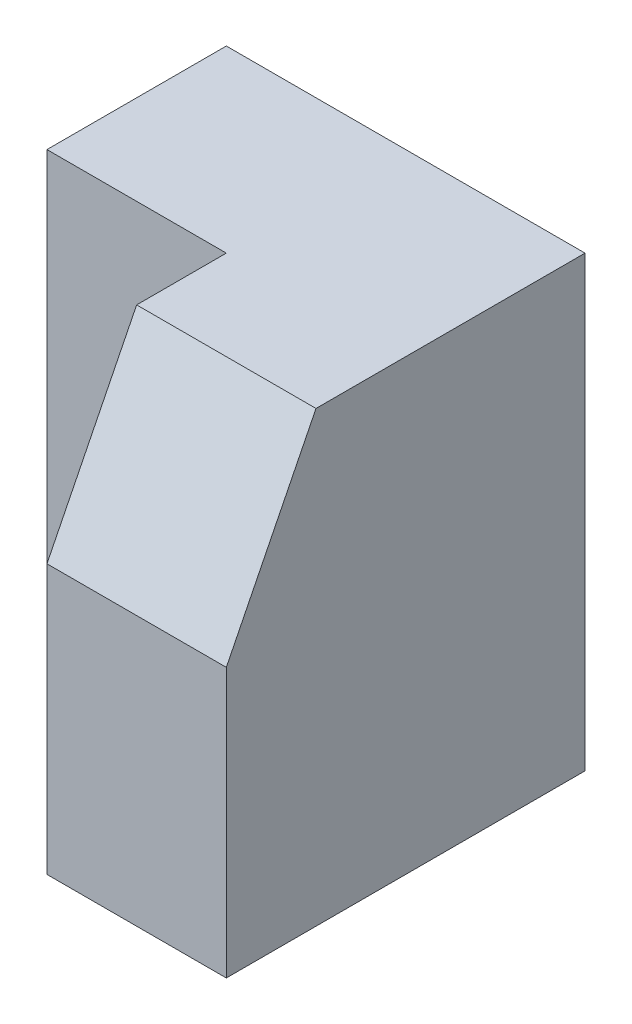
ISO-10303-21;
HEADER;
FILE_DESCRIPTION(('STEP AP214'),'2;1');
FILE_NAME('part.step','',(''),(''),'','','');
FILE_SCHEMA(('AUTOMOTIVE_DESIGN { 1 0 10303 214 1 1 1 1 }'));
ENDSEC;
DATA;
#1=APPLICATION_CONTEXT('core data for automotive mechanical design processes');
#2=APPLICATION_PROTOCOL_DEFINITION('international standard','automotive_design',2000,#1);
#3=PRODUCT_CONTEXT('',#1,'mechanical');
#4=PRODUCT('Part','Part','',(#3));
#5=PRODUCT_RELATED_PRODUCT_CATEGORY('part','',(#4));
#6=PRODUCT_DEFINITION_FORMATION('','',#4);
#7=PRODUCT_DEFINITION_CONTEXT('part definition',#1,'design');
#8=PRODUCT_DEFINITION('design','',#6,#7);
#9=PRODUCT_DEFINITION_SHAPE('','',#8);
#10=(LENGTH_UNIT() NAMED_UNIT(*) SI_UNIT(.MILLI.,.METRE.));
#11=(NAMED_UNIT(*) PLANE_ANGLE_UNIT() SI_UNIT($,.RADIAN.));
#12=(NAMED_UNIT(*) SI_UNIT($,.STERADIAN.) SOLID_ANGLE_UNIT());
#13=UNCERTAINTY_MEASURE_WITH_UNIT(LENGTH_MEASURE(1.E-05),#10,'distance_accuracy_value','');
#14=(GEOMETRIC_REPRESENTATION_CONTEXT(3) GLOBAL_UNCERTAINTY_ASSIGNED_CONTEXT((#13)) GLOBAL_UNIT_ASSIGNED_CONTEXT((#10,
#11,#12)) REPRESENTATION_CONTEXT('',''));
#15=CARTESIAN_POINT('',(0.,0.,0.));
#16=DIRECTION('',(0.,0.,1.));
#17=DIRECTION('',(1.,0.,0.));
#18=AXIS2_PLACEMENT_3D('',#15,#16,#17);
#19=CARTESIAN_POINT('',(0.,0.,20.));
#20=DIRECTION('',(0.,1.,0.));
#21=DIRECTION('',(0.,0.,1.));
#22=AXIS2_PLACEMENT_3D('',#19,#20,#21);
#23=PLANE('',#22);
#24=DIRECTION('',(1.,0.,0.));
#25=VECTOR('',#24,1.);
#26=CARTESIAN_POINT('',(0.,0.,10.));
#27=LINE('',#26,#25);
#28=CARTESIAN_POINT('',(10.,0.,10.));
#29=VERTEX_POINT('',#28);
#30=CARTESIAN_POINT('',(20.,0.,10.));
#31=VERTEX_POINT('',#30);
#32=EDGE_CURVE('E121',#29,#31,#27,.T.);
#33=ORIENTED_EDGE('',*,*,#32,.F.);
#34=DIRECTION('',(-0.707106781186548,0.,-0.707106781186548));
#35=VECTOR('',#34,1.);
#36=CARTESIAN_POINT('',(10.,0.,10.));
#37=LINE('',#36,#35);
#38=CARTESIAN_POINT('',(0.,0.,0.));
#39=VERTEX_POINT('',#38);
#40=EDGE_CURVE('E162',#29,#39,#37,.T.);
#41=ORIENTED_EDGE('',*,*,#40,.T.);
#42=DIRECTION('',(1.,0.,0.));
#43=VECTOR('',#42,1.);
#44=CARTESIAN_POINT('',(0.,0.,0.));
#45=LINE('',#44,#43);
#46=CARTESIAN_POINT('',(30.,0.,0.));
#47=VERTEX_POINT('',#46);
#48=EDGE_CURVE('E138',#39,#47,#45,.T.);
#49=ORIENTED_EDGE('',*,*,#48,.T.);
#50=DIRECTION('',(0.,0.,-1.));
#51=VECTOR('',#50,1.);
#52=CARTESIAN_POINT('',(30.,0.,20.));
#53=LINE('',#52,#51);
#54=CARTESIAN_POINT('',(30.,0.,20.));
#55=VERTEX_POINT('',#54);
#56=EDGE_CURVE('E145',#55,#47,#53,.T.);
#57=ORIENTED_EDGE('',*,*,#56,.F.);
#58=DIRECTION('',(1.,0.,0.));
#59=VECTOR('',#58,1.);
#60=CARTESIAN_POINT('',(0.,0.,20.));
#61=LINE('',#60,#59);
#62=CARTESIAN_POINT('',(20.,0.,20.));
#63=VERTEX_POINT('',#62);
#64=EDGE_CURVE('E131',#63,#55,#61,.T.);
#65=ORIENTED_EDGE('',*,*,#64,.F.);
#66=DIRECTION('',(0.,0.,1.));
#67=VECTOR('',#66,1.);
#68=CARTESIAN_POINT('',(20.,0.,10.));
#69=LINE('',#68,#67);
#70=EDGE_CURVE('E117',#31,#63,#69,.T.);
#71=ORIENTED_EDGE('',*,*,#70,.F.);
#72=EDGE_LOOP('',(#33,#41,#49,#57,#65,#71));
#73=FACE_BOUND('',#72,.T.);
#74=ADVANCED_FACE('F33',(#73),#23,.F.);
#75=CARTESIAN_POINT('',(30.,0.,20.));
#76=DIRECTION('',(-1.,0.,0.));
#77=DIRECTION('',(0.,0.,1.));
#78=AXIS2_PLACEMENT_3D('',#75,#76,#77);
#79=PLANE('',#78);
#80=DIRECTION('',(0.,0.,-1.));
#81=VECTOR('',#80,1.);
#82=CARTESIAN_POINT('',(30.,25.,20.));
#83=LINE('',#82,#81);
#84=CARTESIAN_POINT('',(30.,25.,15.));
#85=VERTEX_POINT('',#84);
#86=CARTESIAN_POINT('',(30.,25.,0.));
#87=VERTEX_POINT('',#86);
#88=EDGE_CURVE('E136',#85,#87,#83,.T.);
#89=ORIENTED_EDGE('',*,*,#88,.F.);
#90=DIRECTION('',(0.,-0.894427190999916,0.447213595499958));
#91=VECTOR('',#90,1.);
#92=CARTESIAN_POINT('',(30.,3.,26.));
#93=LINE('',#92,#91);
#94=CARTESIAN_POINT('',(30.,15.,20.));
#95=VERTEX_POINT('',#94);
#96=EDGE_CURVE('E128',#85,#95,#93,.T.);
#97=ORIENTED_EDGE('',*,*,#96,.T.);
#98=DIRECTION('',(0.,1.,0.));
#99=VECTOR('',#98,1.);
#100=CARTESIAN_POINT('',(30.,0.,20.));
#101=LINE('',#100,#99);
#102=EDGE_CURVE('E133',#55,#95,#101,.T.);
#103=ORIENTED_EDGE('',*,*,#102,.F.);
#104=ORIENTED_EDGE('',*,*,#56,.T.);
#105=DIRECTION('',(0.,1.,0.));
#106=VECTOR('',#105,1.);
#107=CARTESIAN_POINT('',(30.,0.,0.));
#108=LINE('',#107,#106);
#109=EDGE_CURVE('E140',#47,#87,#108,.T.);
#110=ORIENTED_EDGE('',*,*,#109,.T.);
#111=EDGE_LOOP('',(#89,#97,#103,#104,#110));
#112=FACE_BOUND('',#111,.T.);
#113=ADVANCED_FACE('F152',(#112),#79,.F.);
#114=CARTESIAN_POINT('',(0.,25.,20.));
#115=DIRECTION('',(0.,-1.,0.));
#116=DIRECTION('',(0.,0.,-1.));
#117=AXIS2_PLACEMENT_3D('',#114,#115,#116);
#118=PLANE('',#117);
#119=DIRECTION('',(-1.,0.,0.));
#120=VECTOR('',#119,1.);
#121=CARTESIAN_POINT('',(0.,25.,0.));
#122=LINE('',#121,#120);
#123=CARTESIAN_POINT('',(10.,25.,0.));
#124=VERTEX_POINT('',#123);
#125=EDGE_CURVE('E110',#87,#124,#122,.T.);
#126=ORIENTED_EDGE('',*,*,#125,.T.);
#127=DIRECTION('',(0.,0.,1.));
#128=VECTOR('',#127,1.);
#129=CARTESIAN_POINT('',(10.,25.,-10.));
#130=LINE('',#129,#128);
#131=CARTESIAN_POINT('',(10.,25.,10.));
#132=VERTEX_POINT('',#131);
#133=EDGE_CURVE('E100',#124,#132,#130,.T.);
#134=ORIENTED_EDGE('',*,*,#133,.T.);
#135=DIRECTION('',(-1.,0.,0.));
#136=VECTOR('',#135,1.);
#137=CARTESIAN_POINT('',(0.,25.,10.));
#138=LINE('',#137,#136);
#139=CARTESIAN_POINT('',(20.,25.,10.));
#140=VERTEX_POINT('',#139);
#141=EDGE_CURVE('E108',#140,#132,#138,.T.);
#142=ORIENTED_EDGE('',*,*,#141,.F.);
#143=DIRECTION('',(0.,0.,1.));
#144=VECTOR('',#143,1.);
#145=CARTESIAN_POINT('',(20.,25.,10.));
#146=LINE('',#145,#144);
#147=CARTESIAN_POINT('',(20.,25.,15.));
#148=VERTEX_POINT('',#147);
#149=EDGE_CURVE('E119',#140,#148,#146,.T.);
#150=ORIENTED_EDGE('',*,*,#149,.T.);
#151=DIRECTION('',(-1.,0.,0.));
#152=VECTOR('',#151,1.);
#153=CARTESIAN_POINT('',(40.,25.,15.));
#154=LINE('',#153,#152);
#155=EDGE_CURVE('E171',#85,#148,#154,.T.);
#156=ORIENTED_EDGE('',*,*,#155,.F.);
#157=ORIENTED_EDGE('',*,*,#88,.T.);
#158=EDGE_LOOP('',(#126,#134,#142,#150,#156,#157));
#159=FACE_BOUND('',#158,.T.);
#160=ADVANCED_FACE('F106',(#159),#118,.F.);
#161=CARTESIAN_POINT('',(0.,0.,20.));
#162=DIRECTION('',(0.,0.,-1.));
#163=DIRECTION('',(-1.,0.,0.));
#164=AXIS2_PLACEMENT_3D('',#161,#162,#163);
#165=PLANE('',#164);
#166=ORIENTED_EDGE('',*,*,#102,.T.);
#167=DIRECTION('',(-1.,0.,0.));
#168=VECTOR('',#167,1.);
#169=CARTESIAN_POINT('',(40.,15.,20.));
#170=LINE('',#169,#168);
#171=CARTESIAN_POINT('',(20.,15.,20.));
#172=VERTEX_POINT('',#171);
#173=EDGE_CURVE('E172',#95,#172,#170,.T.);
#174=ORIENTED_EDGE('',*,*,#173,.T.);
#175=DIRECTION('',(0.,1.,0.));
#176=VECTOR('',#175,1.);
#177=CARTESIAN_POINT('',(20.,0.,20.));
#178=LINE('',#177,#176);
#179=EDGE_CURVE('E125',#63,#172,#178,.T.);
#180=ORIENTED_EDGE('',*,*,#179,.F.);
#181=ORIENTED_EDGE('',*,*,#64,.T.);
#182=EDGE_LOOP('',(#166,#174,#180,#181));
#183=FACE_BOUND('',#182,.T.);
#184=ADVANCED_FACE('F183',(#183),#165,.F.);
#185=CARTESIAN_POINT('',(0.,0.,0.));
#186=DIRECTION('',(0.,0.,-1.));
#187=DIRECTION('',(-1.,0.,0.));
#188=AXIS2_PLACEMENT_3D('',#185,#186,#187);
#189=PLANE('',#188);
#190=DIRECTION('',(0.,-1.,0.));
#191=VECTOR('',#190,1.);
#192=CARTESIAN_POINT('',(10.,0.,0.));
#193=LINE('',#192,#191);
#194=CARTESIAN_POINT('',(10.,14.9983094984835,0.));
#195=VERTEX_POINT('',#194);
#196=EDGE_CURVE('E161',#124,#195,#193,.T.);
#197=ORIENTED_EDGE('',*,*,#196,.F.);
#198=ORIENTED_EDGE('',*,*,#125,.F.);
#199=ORIENTED_EDGE('',*,*,#109,.F.);
#200=ORIENTED_EDGE('',*,*,#48,.F.);
#201=DIRECTION('',(0.,-1.,0.));
#202=VECTOR('',#201,1.);
#203=CARTESIAN_POINT('',(0.,0.,0.));
#204=LINE('',#203,#202);
#205=CARTESIAN_POINT('',(0.,14.9983094984835,0.));
#206=VERTEX_POINT('',#205);
#207=EDGE_CURVE('E129',#206,#39,#204,.T.);
#208=ORIENTED_EDGE('',*,*,#207,.F.);
#209=DIRECTION('',(-1.,0.,0.));
#210=VECTOR('',#209,1.);
#211=CARTESIAN_POINT('',(0.,14.9983094984835,0.));
#212=LINE('',#211,#210);
#213=EDGE_CURVE('E111',#195,#206,#212,.T.);
#214=ORIENTED_EDGE('',*,*,#213,.F.);
#215=EDGE_LOOP('',(#197,#198,#199,#200,#208,#214));
#216=FACE_BOUND('',#215,.T.);
#217=ADVANCED_FACE('F158',(#216),#189,.T.);
#218=CARTESIAN_POINT('',(20.,0.,10.));
#219=DIRECTION('',(1.,0.,0.));
#220=DIRECTION('',(0.,0.,-1.));
#221=AXIS2_PLACEMENT_3D('',#218,#219,#220);
#222=PLANE('',#221);
#223=ORIENTED_EDGE('',*,*,#179,.T.);
#224=DIRECTION('',(0.,-0.894427190999916,0.447213595499958));
#225=VECTOR('',#224,1.);
#226=CARTESIAN_POINT('',(20.,25.,15.));
#227=LINE('',#226,#225);
#228=EDGE_CURVE('E165',#148,#172,#227,.T.);
#229=ORIENTED_EDGE('',*,*,#228,.F.);
#230=ORIENTED_EDGE('',*,*,#149,.F.);
#231=DIRECTION('',(0.,1.,0.));
#232=VECTOR('',#231,1.);
#233=CARTESIAN_POINT('',(20.,0.,10.));
#234=LINE('',#233,#232);
#235=EDGE_CURVE('E116',#31,#140,#234,.T.);
#236=ORIENTED_EDGE('',*,*,#235,.F.);
#237=ORIENTED_EDGE('',*,*,#70,.T.);
#238=EDGE_LOOP('',(#223,#229,#230,#236,#237));
#239=FACE_BOUND('',#238,.T.);
#240=ADVANCED_FACE('F179',(#239),#222,.F.);
#241=CARTESIAN_POINT('',(0.,0.,10.));
#242=DIRECTION('',(0.,0.,-1.));
#243=DIRECTION('',(-1.,0.,0.));
#244=AXIS2_PLACEMENT_3D('',#241,#242,#243);
#245=PLANE('',#244);
#246=ORIENTED_EDGE('',*,*,#141,.T.);
#247=DIRECTION('',(0.,-1.,0.));
#248=VECTOR('',#247,1.);
#249=CARTESIAN_POINT('',(10.,0.,10.));
#250=LINE('',#249,#248);
#251=CARTESIAN_POINT('',(10.,14.9983094984835,10.));
#252=VERTEX_POINT('',#251);
#253=EDGE_CURVE('E40',#132,#252,#250,.T.);
#254=ORIENTED_EDGE('',*,*,#253,.T.);
#255=EDGE_CURVE('E55',#252,#29,#250,.T.);
#256=ORIENTED_EDGE('',*,*,#255,.T.);
#257=ORIENTED_EDGE('',*,*,#32,.T.);
#258=ORIENTED_EDGE('',*,*,#235,.T.);
#259=EDGE_LOOP('',(#246,#254,#256,#257,#258));
#260=FACE_BOUND('',#259,.T.);
#261=ADVANCED_FACE('F114',(#260),#245,.F.);
#262=CARTESIAN_POINT('',(40.,25.,15.));
#263=DIRECTION('',(0.,-0.447213595499958,-0.894427190999916));
#264=DIRECTION('',(0.,0.894427190999916,-0.447213595499958));
#265=AXIS2_PLACEMENT_3D('',#262,#263,#264);
#266=PLANE('',#265);
#267=ORIENTED_EDGE('',*,*,#155,.T.);
#268=ORIENTED_EDGE('',*,*,#228,.T.);
#269=ORIENTED_EDGE('',*,*,#173,.F.);
#270=ORIENTED_EDGE('',*,*,#96,.F.);
#271=EDGE_LOOP('',(#267,#268,#269,#270));
#272=FACE_BOUND('',#271,.T.);
#273=ADVANCED_FACE('F186',(#272),#266,.F.);
#274=CARTESIAN_POINT('',(10.,-15.,10.));
#275=DIRECTION('',(0.707106781186548,0.,-0.707106781186548));
#276=DIRECTION('',(-0.707106781186548,0.,-0.707106781186548));
#277=AXIS2_PLACEMENT_3D('',#274,#275,#276);
#278=PLANE('',#277);
#279=ORIENTED_EDGE('',*,*,#255,.F.);
#280=DIRECTION('',(-0.707106781186548,0.,-0.707106781186548));
#281=VECTOR('',#280,1.);
#282=CARTESIAN_POINT('',(10.,14.9983094984835,10.));
#283=LINE('',#282,#281);
#284=EDGE_CURVE('E11',#252,#206,#283,.T.);
#285=ORIENTED_EDGE('',*,*,#284,.T.);
#286=ORIENTED_EDGE('',*,*,#207,.T.);
#287=ORIENTED_EDGE('',*,*,#40,.F.);
#288=EDGE_LOOP('',(#279,#285,#286,#287));
#289=FACE_BOUND('',#288,.T.);
#290=ADVANCED_FACE('F188',(#289),#278,.F.);
#291=CARTESIAN_POINT('',(0.,14.9983094984835,-10.));
#292=DIRECTION('',(0.,-1.,0.));
#293=DIRECTION('',(0.,0.,-1.));
#294=AXIS2_PLACEMENT_3D('',#291,#292,#293);
#295=PLANE('',#294);
#296=ORIENTED_EDGE('',*,*,#213,.T.);
#297=ORIENTED_EDGE('',*,*,#284,.F.);
#298=DIRECTION('',(0.,0.,1.));
#299=VECTOR('',#298,1.);
#300=CARTESIAN_POINT('',(10.,14.9983094984835,-10.));
#301=LINE('',#300,#299);
#302=EDGE_CURVE('E47',#195,#252,#301,.T.);
#303=ORIENTED_EDGE('',*,*,#302,.F.);
#304=EDGE_LOOP('',(#296,#297,#303));
#305=FACE_BOUND('',#304,.T.);
#306=ADVANCED_FACE('F195',(#305),#295,.F.);
#307=CARTESIAN_POINT('',(10.,25.,-10.));
#308=DIRECTION('',(1.,0.,0.));
#309=DIRECTION('',(0.,0.,-1.));
#310=AXIS2_PLACEMENT_3D('',#307,#308,#309);
#311=PLANE('',#310);
#312=ORIENTED_EDGE('',*,*,#196,.T.);
#313=ORIENTED_EDGE('',*,*,#302,.T.);
#314=ORIENTED_EDGE('',*,*,#253,.F.);
#315=ORIENTED_EDGE('',*,*,#133,.F.);
#316=EDGE_LOOP('',(#312,#313,#314,#315));
#317=FACE_BOUND('',#316,.T.);
#318=ADVANCED_FACE('F99',(#317),#311,.F.);
#319=CLOSED_SHELL('',(#74,#113,#160,#184,#217,#240,#261,#273,#290,#306,#318));
#320=MANIFOLD_SOLID_BREP('B2',#319);
#321=ADVANCED_BREP_SHAPE_REPRESENTATION('',(#18,#320),#14);
#322=SHAPE_DEFINITION_REPRESENTATION(#9,#321);
ENDSEC;
END-ISO-10303-21;
